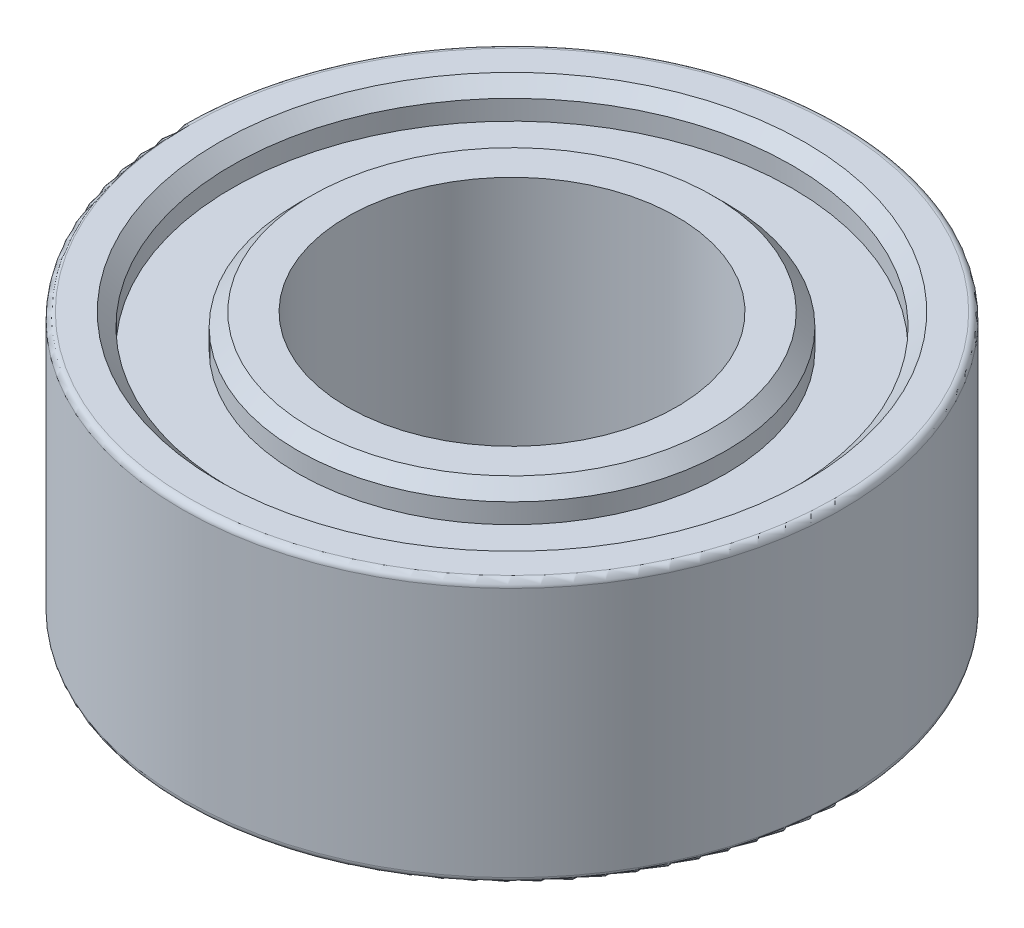
ISO-10303-21;
HEADER;
FILE_DESCRIPTION(('STEP AP214'),'2;1');
FILE_NAME('part.step','',(''),(''),'','','');
FILE_SCHEMA(('AUTOMOTIVE_DESIGN { 1 0 10303 214 1 1 1 1 }'));
ENDSEC;
DATA;
#1=APPLICATION_CONTEXT('core data for automotive mechanical design processes');
#2=APPLICATION_PROTOCOL_DEFINITION('international standard','automotive_design',2000,#1);
#3=PRODUCT_CONTEXT('',#1,'mechanical');
#4=PRODUCT('Part','Part','',(#3));
#5=PRODUCT_RELATED_PRODUCT_CATEGORY('part','',(#4));
#6=PRODUCT_DEFINITION_FORMATION('','',#4);
#7=PRODUCT_DEFINITION_CONTEXT('part definition',#1,'design');
#8=PRODUCT_DEFINITION('design','',#6,#7);
#9=PRODUCT_DEFINITION_SHAPE('','',#8);
#10=(LENGTH_UNIT() NAMED_UNIT(*) SI_UNIT(.MILLI.,.METRE.));
#11=(NAMED_UNIT(*) PLANE_ANGLE_UNIT() SI_UNIT($,.RADIAN.));
#12=(NAMED_UNIT(*) SI_UNIT($,.STERADIAN.) SOLID_ANGLE_UNIT());
#13=UNCERTAINTY_MEASURE_WITH_UNIT(LENGTH_MEASURE(1.E-05),#10,'distance_accuracy_value','');
#14=(GEOMETRIC_REPRESENTATION_CONTEXT(3) GLOBAL_UNCERTAINTY_ASSIGNED_CONTEXT((#13)) GLOBAL_UNIT_ASSIGNED_CONTEXT((#10,
#11,#12)) REPRESENTATION_CONTEXT('',''));
#15=CARTESIAN_POINT('',(0.,0.,0.));
#16=DIRECTION('',(0.,0.,1.));
#17=DIRECTION('',(1.,0.,0.));
#18=AXIS2_PLACEMENT_3D('',#15,#16,#17);
#19=CARTESIAN_POINT('',(0.,-2.,0.));
#20=DIRECTION('',(0.,1.,0.));
#21=DIRECTION('',(0.,0.,1.));
#22=AXIS2_PLACEMENT_3D('',#19,#20,#21);
#23=PLANE('',#22);
#24=CARTESIAN_POINT('',(0.,-2.,0.));
#25=DIRECTION('',(0.,1.,0.));
#26=DIRECTION('',(0.,0.,1.));
#27=AXIS2_PLACEMENT_3D('',#24,#25,#26);
#28=CIRCLE('',#27,3.05);
#29=CARTESIAN_POINT('',(0.,-2.,3.05));
#30=VERTEX_POINT('',#29);
#31=EDGE_CURVE('E66',#30,#30,#28,.F.);
#32=ORIENTED_EDGE('',*,*,#31,.T.);
#33=EDGE_LOOP('',(#32));
#34=FACE_BOUND('',#33,.T.);
#35=CARTESIAN_POINT('',(0.,-2.,0.));
#36=DIRECTION('',(0.,1.,0.));
#37=DIRECTION('',(0.,0.,1.));
#38=AXIS2_PLACEMENT_3D('',#35,#36,#37);
#39=CIRCLE('',#38,2.5);
#40=CARTESIAN_POINT('',(0.,-2.,2.5));
#41=VERTEX_POINT('',#40);
#42=EDGE_CURVE('E79',#41,#41,#39,.T.);
#43=ORIENTED_EDGE('',*,*,#42,.T.);
#44=EDGE_LOOP('',(#43));
#45=FACE_BOUND('',#44,.T.);
#46=ADVANCED_FACE('F34',(#34,#45),#23,.F.);
#47=CARTESIAN_POINT('',(0.,2.,0.));
#48=DIRECTION('',(0.,1.,0.));
#49=DIRECTION('',(0.,0.,1.));
#50=AXIS2_PLACEMENT_3D('',#47,#48,#49);
#51=PLANE('',#50);
#52=CARTESIAN_POINT('',(0.,2.,0.));
#53=DIRECTION('',(0.,1.,0.));
#54=DIRECTION('',(0.,0.,1.));
#55=AXIS2_PLACEMENT_3D('',#52,#53,#54);
#56=CIRCLE('',#55,3.05);
#57=CARTESIAN_POINT('',(0.,2.,3.05));
#58=VERTEX_POINT('',#57);
#59=EDGE_CURVE('E63',#58,#58,#56,.T.);
#60=ORIENTED_EDGE('',*,*,#59,.T.);
#61=EDGE_LOOP('',(#60));
#62=FACE_BOUND('',#61,.T.);
#63=CARTESIAN_POINT('',(0.,2.,0.));
#64=DIRECTION('',(0.,1.,0.));
#65=DIRECTION('',(0.,0.,1.));
#66=AXIS2_PLACEMENT_3D('',#63,#64,#65);
#67=CIRCLE('',#66,2.5);
#68=CARTESIAN_POINT('',(0.,2.,2.5));
#69=VERTEX_POINT('',#68);
#70=EDGE_CURVE('E78',#69,#69,#67,.T.);
#71=ORIENTED_EDGE('',*,*,#70,.F.);
#72=EDGE_LOOP('',(#71));
#73=FACE_BOUND('',#72,.T.);
#74=ADVANCED_FACE('F116',(#62,#73),#51,.T.);
#75=CARTESIAN_POINT('',(0.,2.,0.));
#76=DIRECTION('',(0.,1.,0.));
#77=DIRECTION('',(0.,0.,1.));
#78=AXIS2_PLACEMENT_3D('',#75,#76,#77);
#79=CIRCLE('',#78,4.9);
#80=CARTESIAN_POINT('',(0.,2.,4.9));
#81=VERTEX_POINT('',#80);
#82=EDGE_CURVE('E10',#81,#81,#79,.T.);
#83=ORIENTED_EDGE('',*,*,#82,.T.);
#84=EDGE_LOOP('',(#83));
#85=FACE_BOUND('',#84,.T.);
#86=CARTESIAN_POINT('',(0.,2.,0.));
#87=DIRECTION('',(0.,1.,0.));
#88=DIRECTION('',(0.,0.,1.));
#89=AXIS2_PLACEMENT_3D('',#86,#87,#88);
#90=CIRCLE('',#89,4.45);
#91=CARTESIAN_POINT('',(0.,2.,4.45));
#92=VERTEX_POINT('',#91);
#93=EDGE_CURVE('E54',#92,#92,#90,.F.);
#94=ORIENTED_EDGE('',*,*,#93,.T.);
#95=EDGE_LOOP('',(#94));
#96=FACE_BOUND('',#95,.T.);
#97=ADVANCED_FACE('F123',(#85,#96),#51,.T.);
#98=CARTESIAN_POINT('',(0.,-2.,0.));
#99=DIRECTION('',(0.,1.,0.));
#100=DIRECTION('',(0.,0.,1.));
#101=AXIS2_PLACEMENT_3D('',#98,#99,#100);
#102=CIRCLE('',#101,4.9);
#103=CARTESIAN_POINT('',(0.,-2.,4.9));
#104=VERTEX_POINT('',#103);
#105=EDGE_CURVE('E41',#104,#104,#102,.F.);
#106=ORIENTED_EDGE('',*,*,#105,.T.);
#107=EDGE_LOOP('',(#106));
#108=FACE_BOUND('',#107,.T.);
#109=CARTESIAN_POINT('',(0.,-2.,0.));
#110=DIRECTION('',(0.,1.,0.));
#111=DIRECTION('',(0.,0.,1.));
#112=AXIS2_PLACEMENT_3D('',#109,#110,#111);
#113=CIRCLE('',#112,4.45);
#114=CARTESIAN_POINT('',(0.,-2.,4.45));
#115=VERTEX_POINT('',#114);
#116=EDGE_CURVE('E75',#115,#115,#113,.T.);
#117=ORIENTED_EDGE('',*,*,#116,.T.);
#118=EDGE_LOOP('',(#117));
#119=FACE_BOUND('',#118,.T.);
#120=ADVANCED_FACE('F119',(#108,#119),#23,.F.);
#121=CARTESIAN_POINT('',(0.,2.,0.));
#122=DIRECTION('',(0.,-1.,0.));
#123=DIRECTION('',(0.,0.,-1.));
#124=AXIS2_PLACEMENT_3D('',#121,#122,#123);
#125=CYLINDRICAL_SURFACE('',#124,5.);
#126=CARTESIAN_POINT('',(0.,-1.9,0.));
#127=DIRECTION('',(0.,1.,0.));
#128=DIRECTION('',(0.,0.,1.));
#129=AXIS2_PLACEMENT_3D('',#126,#127,#128);
#130=CIRCLE('',#129,5.);
#131=CARTESIAN_POINT('',(0.,-1.9,5.));
#132=VERTEX_POINT('',#131);
#133=EDGE_CURVE('E45',#132,#132,#130,.T.);
#134=ORIENTED_EDGE('',*,*,#133,.T.);
#135=EDGE_LOOP('',(#134));
#136=FACE_BOUND('',#135,.T.);
#137=CARTESIAN_POINT('',(0.,1.9,0.));
#138=DIRECTION('',(0.,1.,0.));
#139=DIRECTION('',(0.,0.,1.));
#140=AXIS2_PLACEMENT_3D('',#137,#138,#139);
#141=CIRCLE('',#140,5.);
#142=CARTESIAN_POINT('',(0.,1.9,5.));
#143=VERTEX_POINT('',#142);
#144=EDGE_CURVE('E49',#143,#143,#141,.F.);
#145=ORIENTED_EDGE('',*,*,#144,.T.);
#146=EDGE_LOOP('',(#145));
#147=FACE_BOUND('',#146,.T.);
#148=ADVANCED_FACE('F129',(#136,#147),#125,.T.);
#149=CARTESIAN_POINT('',(0.,2.,0.));
#150=DIRECTION('',(0.,-1.,0.));
#151=DIRECTION('',(0.,0.,-1.));
#152=AXIS2_PLACEMENT_3D('',#149,#150,#151);
#153=CYLINDRICAL_SURFACE('',#152,2.5);
#154=ORIENTED_EDGE('',*,*,#70,.T.);
#155=EDGE_LOOP('',(#154));
#156=FACE_BOUND('',#155,.T.);
#157=ORIENTED_EDGE('',*,*,#42,.F.);
#158=EDGE_LOOP('',(#157));
#159=FACE_BOUND('',#158,.T.);
#160=ADVANCED_FACE('F134',(#156,#159),#153,.F.);
#161=CARTESIAN_POINT('',(0.,1.5,0.));
#162=DIRECTION('',(0.,1.,0.));
#163=DIRECTION('',(0.,0.,1.));
#164=AXIS2_PLACEMENT_3D('',#161,#162,#163);
#165=CYLINDRICAL_SURFACE('',#164,4.25);
#166=CARTESIAN_POINT('',(0.,1.8,0.));
#167=DIRECTION('',(0.,1.,0.));
#168=DIRECTION('',(0.,0.,1.));
#169=AXIS2_PLACEMENT_3D('',#166,#167,#168);
#170=CIRCLE('',#169,4.25);
#171=CARTESIAN_POINT('',(0.,1.8,4.25));
#172=VERTEX_POINT('',#171);
#173=EDGE_CURVE('E57',#172,#172,#170,.T.);
#174=ORIENTED_EDGE('',*,*,#173,.T.);
#175=EDGE_LOOP('',(#174));
#176=FACE_BOUND('',#175,.T.);
#177=CARTESIAN_POINT('',(0.,1.5,0.));
#178=DIRECTION('',(0.,1.,0.));
#179=DIRECTION('',(0.,0.,1.));
#180=AXIS2_PLACEMENT_3D('',#177,#178,#179);
#181=CIRCLE('',#180,4.25);
#182=CARTESIAN_POINT('',(0.,1.5,4.25));
#183=VERTEX_POINT('',#182);
#184=EDGE_CURVE('E82',#183,#183,#181,.T.);
#185=ORIENTED_EDGE('',*,*,#184,.F.);
#186=EDGE_LOOP('',(#185));
#187=FACE_BOUND('',#186,.T.);
#188=ADVANCED_FACE('F145',(#176,#187),#165,.F.);
#189=CARTESIAN_POINT('',(0.,1.5,0.));
#190=DIRECTION('',(0.,1.,0.));
#191=DIRECTION('',(0.,0.,1.));
#192=AXIS2_PLACEMENT_3D('',#189,#190,#191);
#193=PLANE('',#192);
#194=CARTESIAN_POINT('',(0.,1.5,0.));
#195=DIRECTION('',(0.,1.,0.));
#196=DIRECTION('',(0.,0.,1.));
#197=AXIS2_PLACEMENT_3D('',#194,#195,#196);
#198=CIRCLE('',#197,3.25);
#199=CARTESIAN_POINT('',(0.,1.5,3.25));
#200=VERTEX_POINT('',#199);
#201=EDGE_CURVE('E87',#200,#200,#198,.T.);
#202=ORIENTED_EDGE('',*,*,#201,.F.);
#203=EDGE_LOOP('',(#202));
#204=FACE_BOUND('',#203,.T.);
#205=ORIENTED_EDGE('',*,*,#184,.T.);
#206=EDGE_LOOP('',(#205));
#207=FACE_BOUND('',#206,.T.);
#208=ADVANCED_FACE('F149',(#204,#207),#193,.T.);
#209=CARTESIAN_POINT('',(0.,1.5,0.));
#210=DIRECTION('',(0.,1.,0.));
#211=DIRECTION('',(0.,0.,1.));
#212=AXIS2_PLACEMENT_3D('',#209,#210,#211);
#213=CYLINDRICAL_SURFACE('',#212,3.25);
#214=CARTESIAN_POINT('',(0.,1.8,0.));
#215=DIRECTION('',(0.,1.,0.));
#216=DIRECTION('',(0.,0.,1.));
#217=AXIS2_PLACEMENT_3D('',#214,#215,#216);
#218=CIRCLE('',#217,3.25);
#219=CARTESIAN_POINT('',(0.,1.8,3.25));
#220=VERTEX_POINT('',#219);
#221=EDGE_CURVE('E60',#220,#220,#218,.F.);
#222=ORIENTED_EDGE('',*,*,#221,.T.);
#223=EDGE_LOOP('',(#222));
#224=FACE_BOUND('',#223,.T.);
#225=ORIENTED_EDGE('',*,*,#201,.T.);
#226=EDGE_LOOP('',(#225));
#227=FACE_BOUND('',#226,.T.);
#228=ADVANCED_FACE('F153',(#224,#227),#213,.T.);
#229=CARTESIAN_POINT('',(0.,-1.5,0.));
#230=DIRECTION('',(0.,-1.,0.));
#231=DIRECTION('',(0.,0.,1.));
#232=AXIS2_PLACEMENT_3D('',#229,#230,#231);
#233=PLANE('',#232);
#234=CARTESIAN_POINT('',(0.,-1.5,0.));
#235=DIRECTION('',(0.,1.,0.));
#236=DIRECTION('',(0.,0.,1.));
#237=AXIS2_PLACEMENT_3D('',#234,#235,#236);
#238=CIRCLE('',#237,4.25);
#239=CARTESIAN_POINT('',(0.,-1.5,4.25));
#240=VERTEX_POINT('',#239);
#241=EDGE_CURVE('E90',#240,#240,#238,.T.);
#242=ORIENTED_EDGE('',*,*,#241,.F.);
#243=EDGE_LOOP('',(#242));
#244=FACE_BOUND('',#243,.T.);
#245=CARTESIAN_POINT('',(0.,-1.5,0.));
#246=DIRECTION('',(0.,1.,0.));
#247=DIRECTION('',(0.,0.,1.));
#248=AXIS2_PLACEMENT_3D('',#245,#246,#247);
#249=CIRCLE('',#248,3.25);
#250=CARTESIAN_POINT('',(0.,-1.5,3.25));
#251=VERTEX_POINT('',#250);
#252=EDGE_CURVE('E93',#251,#251,#249,.T.);
#253=ORIENTED_EDGE('',*,*,#252,.T.);
#254=EDGE_LOOP('',(#253));
#255=FACE_BOUND('',#254,.T.);
#256=ADVANCED_FACE('F97',(#244,#255),#233,.T.);
#257=CARTESIAN_POINT('',(0.,-1.5,0.));
#258=DIRECTION('',(0.,-1.,0.));
#259=DIRECTION('',(0.,0.,-1.));
#260=AXIS2_PLACEMENT_3D('',#257,#258,#259);
#261=CYLINDRICAL_SURFACE('',#260,4.25);
#262=CARTESIAN_POINT('',(0.,-1.8,0.));
#263=DIRECTION('',(0.,1.,0.));
#264=DIRECTION('',(0.,0.,1.));
#265=AXIS2_PLACEMENT_3D('',#262,#263,#264);
#266=CIRCLE('',#265,4.25);
#267=CARTESIAN_POINT('',(0.,-1.8,4.25));
#268=VERTEX_POINT('',#267);
#269=EDGE_CURVE('E72',#268,#268,#266,.F.);
#270=ORIENTED_EDGE('',*,*,#269,.T.);
#271=EDGE_LOOP('',(#270));
#272=FACE_BOUND('',#271,.T.);
#273=ORIENTED_EDGE('',*,*,#241,.T.);
#274=EDGE_LOOP('',(#273));
#275=FACE_BOUND('',#274,.T.);
#276=ADVANCED_FACE('F102',(#272,#275),#261,.F.);
#277=CARTESIAN_POINT('',(0.,-1.5,0.));
#278=DIRECTION('',(0.,-1.,0.));
#279=DIRECTION('',(0.,0.,-1.));
#280=AXIS2_PLACEMENT_3D('',#277,#278,#279);
#281=CYLINDRICAL_SURFACE('',#280,3.25);
#282=CARTESIAN_POINT('',(0.,-1.8,0.));
#283=DIRECTION('',(0.,1.,0.));
#284=DIRECTION('',(0.,0.,1.));
#285=AXIS2_PLACEMENT_3D('',#282,#283,#284);
#286=CIRCLE('',#285,3.25);
#287=CARTESIAN_POINT('',(0.,-1.8,3.25));
#288=VERTEX_POINT('',#287);
#289=EDGE_CURVE('E69',#288,#288,#286,.T.);
#290=ORIENTED_EDGE('',*,*,#289,.T.);
#291=EDGE_LOOP('',(#290));
#292=FACE_BOUND('',#291,.T.);
#293=ORIENTED_EDGE('',*,*,#252,.F.);
#294=EDGE_LOOP('',(#293));
#295=FACE_BOUND('',#294,.T.);
#296=ADVANCED_FACE('F99',(#292,#295),#281,.T.);
#297=CARTESIAN_POINT('',(0.,-2.,0.));
#298=DIRECTION('',(0.,-1.,0.));
#299=DIRECTION('',(0.,0.,-1.));
#300=AXIS2_PLACEMENT_3D('',#297,#298,#299);
#301=CONICAL_SURFACE('',#300,4.45,0.785398163397444);
#302=ORIENTED_EDGE('',*,*,#269,.F.);
#303=EDGE_LOOP('',(#302));
#304=FACE_BOUND('',#303,.T.);
#305=ORIENTED_EDGE('',*,*,#116,.F.);
#306=EDGE_LOOP('',(#305));
#307=FACE_BOUND('',#306,.T.);
#308=ADVANCED_FACE('F101',(#304,#307),#301,.F.);
#309=CARTESIAN_POINT('',(0.,-1.8,0.));
#310=DIRECTION('',(0.,1.,0.));
#311=DIRECTION('',(0.,0.,1.));
#312=AXIS2_PLACEMENT_3D('',#309,#310,#311);
#313=CONICAL_SURFACE('',#312,3.25,0.78539816339745);
#314=ORIENTED_EDGE('',*,*,#31,.F.);
#315=EDGE_LOOP('',(#314));
#316=FACE_BOUND('',#315,.T.);
#317=ORIENTED_EDGE('',*,*,#289,.F.);
#318=EDGE_LOOP('',(#317));
#319=FACE_BOUND('',#318,.T.);
#320=ADVANCED_FACE('F109',(#316,#319),#313,.T.);
#321=CARTESIAN_POINT('',(0.,2.,0.));
#322=DIRECTION('',(0.,-1.,0.));
#323=DIRECTION('',(0.,0.,-1.));
#324=AXIS2_PLACEMENT_3D('',#321,#322,#323);
#325=CONICAL_SURFACE('',#324,3.05,0.785398163397444);
#326=ORIENTED_EDGE('',*,*,#221,.F.);
#327=EDGE_LOOP('',(#326));
#328=FACE_BOUND('',#327,.T.);
#329=ORIENTED_EDGE('',*,*,#59,.F.);
#330=EDGE_LOOP('',(#329));
#331=FACE_BOUND('',#330,.T.);
#332=ADVANCED_FACE('F192',(#328,#331),#325,.T.);
#333=CARTESIAN_POINT('',(0.,1.8,0.));
#334=DIRECTION('',(0.,1.,0.));
#335=DIRECTION('',(0.,0.,1.));
#336=AXIS2_PLACEMENT_3D('',#333,#334,#335);
#337=CONICAL_SURFACE('',#336,4.25,0.785398163397453);
#338=ORIENTED_EDGE('',*,*,#93,.F.);
#339=EDGE_LOOP('',(#338));
#340=FACE_BOUND('',#339,.T.);
#341=ORIENTED_EDGE('',*,*,#173,.F.);
#342=EDGE_LOOP('',(#341));
#343=FACE_BOUND('',#342,.T.);
#344=ADVANCED_FACE('F202',(#340,#343),#337,.F.);
#345=CARTESIAN_POINT('',(0.,-1.9,0.));
#346=DIRECTION('',(0.,1.,0.));
#347=DIRECTION('',(0.,0.,1.));
#348=AXIS2_PLACEMENT_3D('',#345,#346,#347);
#349=TOROIDAL_SURFACE('',#348,4.9,0.1);
#350=ORIENTED_EDGE('',*,*,#105,.F.);
#351=EDGE_LOOP('',(#350));
#352=FACE_BOUND('',#351,.T.);
#353=ORIENTED_EDGE('',*,*,#133,.F.);
#354=EDGE_LOOP('',(#353));
#355=FACE_BOUND('',#354,.T.);
#356=ADVANCED_FACE('F211',(#352,#355),#349,.T.);
#357=CARTESIAN_POINT('',(0.,1.9,0.));
#358=DIRECTION('',(0.,1.,0.));
#359=DIRECTION('',(0.,0.,1.));
#360=AXIS2_PLACEMENT_3D('',#357,#358,#359);
#361=TOROIDAL_SURFACE('',#360,4.9,0.1);
#362=ORIENTED_EDGE('',*,*,#144,.F.);
#363=EDGE_LOOP('',(#362));
#364=FACE_BOUND('',#363,.T.);
#365=ORIENTED_EDGE('',*,*,#82,.F.);
#366=EDGE_LOOP('',(#365));
#367=FACE_BOUND('',#366,.T.);
#368=ADVANCED_FACE('F36',(#364,#367),#361,.T.);
#369=CLOSED_SHELL('',(#46,#74,#97,#120,#148,#160,#188,#208,#228,#256,#276,#296,#308,#320,#332,
#344,#356,#368));
#370=MANIFOLD_SOLID_BREP('B2',#369);
#371=ADVANCED_BREP_SHAPE_REPRESENTATION('',(#18,#370),#14);
#372=SHAPE_DEFINITION_REPRESENTATION(#9,#371);
ENDSEC;
END-ISO-10303-21;
